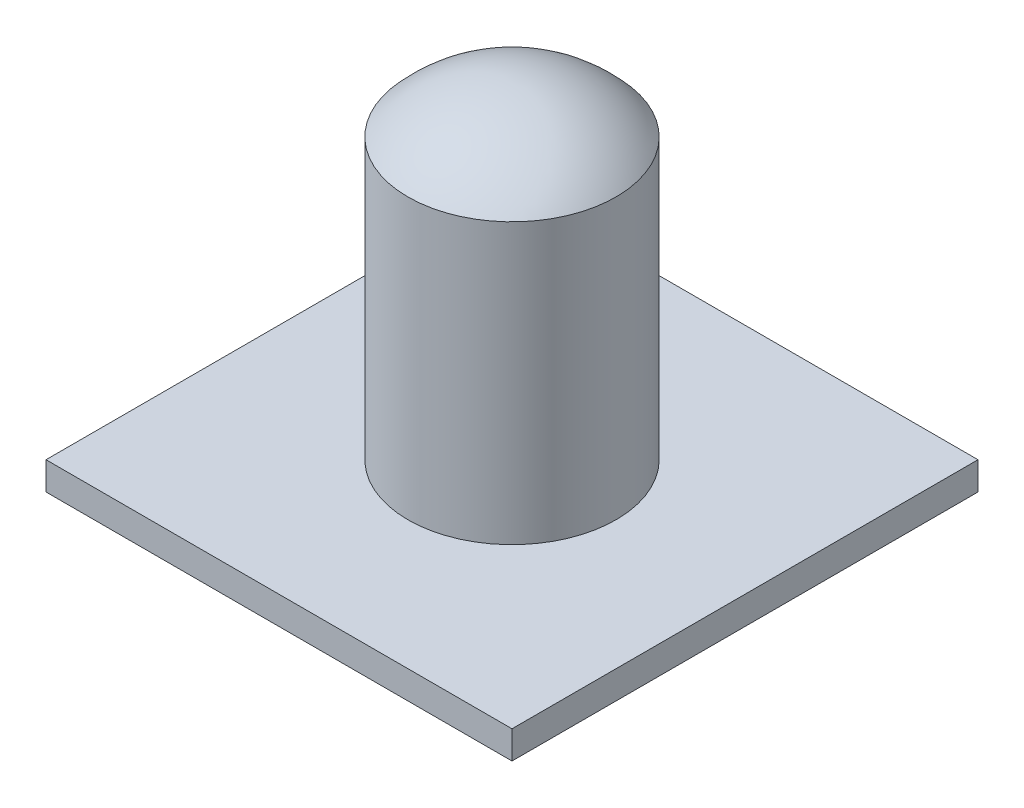
ISO-10303-21;
HEADER;
FILE_DESCRIPTION(('STEP AP214'),'2;1');
FILE_NAME('part.step','',(''),(''),'','','');
FILE_SCHEMA(('AUTOMOTIVE_DESIGN { 1 0 10303 214 1 1 1 1 }'));
ENDSEC;
DATA;
#1=APPLICATION_CONTEXT('core data for automotive mechanical design processes');
#2=APPLICATION_PROTOCOL_DEFINITION('international standard','automotive_design',2000,#1);
#3=PRODUCT_CONTEXT('',#1,'mechanical');
#4=PRODUCT('Part','Part','',(#3));
#5=PRODUCT_RELATED_PRODUCT_CATEGORY('part','',(#4));
#6=PRODUCT_DEFINITION_FORMATION('','',#4);
#7=PRODUCT_DEFINITION_CONTEXT('part definition',#1,'design');
#8=PRODUCT_DEFINITION('design','',#6,#7);
#9=PRODUCT_DEFINITION_SHAPE('','',#8);
#10=(LENGTH_UNIT() NAMED_UNIT(*) SI_UNIT(.MILLI.,.METRE.));
#11=(NAMED_UNIT(*) PLANE_ANGLE_UNIT() SI_UNIT($,.RADIAN.));
#12=(NAMED_UNIT(*) SI_UNIT($,.STERADIAN.) SOLID_ANGLE_UNIT());
#13=UNCERTAINTY_MEASURE_WITH_UNIT(LENGTH_MEASURE(1.E-05),#10,'distance_accuracy_value','');
#14=(GEOMETRIC_REPRESENTATION_CONTEXT(3) GLOBAL_UNCERTAINTY_ASSIGNED_CONTEXT((#13)) GLOBAL_UNIT_ASSIGNED_CONTEXT((#10,
#11,#12)) REPRESENTATION_CONTEXT('',''));
#15=CARTESIAN_POINT('',(0.,0.,0.));
#16=DIRECTION('',(0.,0.,1.));
#17=DIRECTION('',(1.,0.,0.));
#18=AXIS2_PLACEMENT_3D('',#15,#16,#17);
#19=CARTESIAN_POINT('',(-19.05,2.286,-19.05));
#20=DIRECTION('',(1.,0.,0.));
#21=DIRECTION('',(0.,0.,-1.));
#22=AXIS2_PLACEMENT_3D('',#19,#20,#21);
#23=PLANE('',#22);
#24=DIRECTION('',(0.,0.,1.));
#25=VECTOR('',#24,1.);
#26=CARTESIAN_POINT('',(-19.05,0.,-19.05));
#27=LINE('',#26,#25);
#28=CARTESIAN_POINT('',(-19.05,0.,-19.05));
#29=VERTEX_POINT('',#28);
#30=CARTESIAN_POINT('',(-19.05,0.,19.05));
#31=VERTEX_POINT('',#30);
#32=EDGE_CURVE('E115',#29,#31,#27,.T.);
#33=ORIENTED_EDGE('',*,*,#32,.T.);
#34=DIRECTION('',(0.,-1.,0.));
#35=VECTOR('',#34,1.);
#36=CARTESIAN_POINT('',(-19.05,2.286,19.05));
#37=LINE('',#36,#35);
#38=CARTESIAN_POINT('',(-19.05,2.286,19.05));
#39=VERTEX_POINT('',#38);
#40=EDGE_CURVE('E52',#39,#31,#37,.T.);
#41=ORIENTED_EDGE('',*,*,#40,.F.);
#42=DIRECTION('',(0.,0.,1.));
#43=VECTOR('',#42,1.);
#44=CARTESIAN_POINT('',(-19.05,2.286,-19.05));
#45=LINE('',#44,#43);
#46=CARTESIAN_POINT('',(-19.05,2.286,-19.05));
#47=VERTEX_POINT('',#46);
#48=EDGE_CURVE('E97',#47,#39,#45,.T.);
#49=ORIENTED_EDGE('',*,*,#48,.F.);
#50=DIRECTION('',(0.,-1.,0.));
#51=VECTOR('',#50,1.);
#52=CARTESIAN_POINT('',(-19.05,2.286,-19.05));
#53=LINE('',#52,#51);
#54=EDGE_CURVE('E111',#47,#29,#53,.T.);
#55=ORIENTED_EDGE('',*,*,#54,.T.);
#56=EDGE_LOOP('',(#33,#41,#49,#55));
#57=FACE_BOUND('',#56,.T.);
#58=ADVANCED_FACE('F41',(#57),#23,.F.);
#59=CARTESIAN_POINT('',(-19.05,2.286,19.05));
#60=DIRECTION('',(0.,0.,-1.));
#61=DIRECTION('',(-1.,0.,0.));
#62=AXIS2_PLACEMENT_3D('',#59,#60,#61);
#63=PLANE('',#62);
#64=DIRECTION('',(1.,0.,0.));
#65=VECTOR('',#64,1.);
#66=CARTESIAN_POINT('',(-19.05,0.,19.05));
#67=LINE('',#66,#65);
#68=CARTESIAN_POINT('',(19.05,0.,19.05));
#69=VERTEX_POINT('',#68);
#70=EDGE_CURVE('E103',#31,#69,#67,.T.);
#71=ORIENTED_EDGE('',*,*,#70,.T.);
#72=DIRECTION('',(0.,-1.,0.));
#73=VECTOR('',#72,1.);
#74=CARTESIAN_POINT('',(19.05,2.286,19.05));
#75=LINE('',#74,#73);
#76=CARTESIAN_POINT('',(19.05,2.286,19.05));
#77=VERTEX_POINT('',#76);
#78=EDGE_CURVE('E101',#77,#69,#75,.T.);
#79=ORIENTED_EDGE('',*,*,#78,.F.);
#80=DIRECTION('',(1.,0.,0.));
#81=VECTOR('',#80,1.);
#82=CARTESIAN_POINT('',(-19.05,2.286,19.05));
#83=LINE('',#82,#81);
#84=EDGE_CURVE('E92',#39,#77,#83,.T.);
#85=ORIENTED_EDGE('',*,*,#84,.F.);
#86=ORIENTED_EDGE('',*,*,#40,.T.);
#87=EDGE_LOOP('',(#71,#79,#85,#86));
#88=FACE_BOUND('',#87,.T.);
#89=ADVANCED_FACE('F102',(#88),#63,.F.);
#90=CARTESIAN_POINT('',(19.05,2.286,19.05));
#91=DIRECTION('',(-1.,0.,0.));
#92=DIRECTION('',(0.,0.,1.));
#93=AXIS2_PLACEMENT_3D('',#90,#91,#92);
#94=PLANE('',#93);
#95=DIRECTION('',(0.,0.,-1.));
#96=VECTOR('',#95,1.);
#97=CARTESIAN_POINT('',(19.05,0.,19.05));
#98=LINE('',#97,#96);
#99=CARTESIAN_POINT('',(19.05,0.,-19.05));
#100=VERTEX_POINT('',#99);
#101=EDGE_CURVE('E78',#69,#100,#98,.T.);
#102=ORIENTED_EDGE('',*,*,#101,.T.);
#103=DIRECTION('',(0.,-1.,0.));
#104=VECTOR('',#103,1.);
#105=CARTESIAN_POINT('',(19.05,2.286,-19.05));
#106=LINE('',#105,#104);
#107=CARTESIAN_POINT('',(19.05,2.286,-19.05));
#108=VERTEX_POINT('',#107);
#109=EDGE_CURVE('E105',#108,#100,#106,.T.);
#110=ORIENTED_EDGE('',*,*,#109,.F.);
#111=DIRECTION('',(0.,0.,-1.));
#112=VECTOR('',#111,1.);
#113=CARTESIAN_POINT('',(19.05,2.286,19.05));
#114=LINE('',#113,#112);
#115=EDGE_CURVE('E95',#77,#108,#114,.T.);
#116=ORIENTED_EDGE('',*,*,#115,.F.);
#117=ORIENTED_EDGE('',*,*,#78,.T.);
#118=EDGE_LOOP('',(#102,#110,#116,#117));
#119=FACE_BOUND('',#118,.T.);
#120=ADVANCED_FACE('F107',(#119),#94,.F.);
#121=CARTESIAN_POINT('',(19.05,2.286,-19.05));
#122=DIRECTION('',(0.,0.,1.));
#123=DIRECTION('',(1.,0.,0.));
#124=AXIS2_PLACEMENT_3D('',#121,#122,#123);
#125=PLANE('',#124);
#126=DIRECTION('',(-1.,0.,0.));
#127=VECTOR('',#126,1.);
#128=CARTESIAN_POINT('',(19.05,0.,-19.05));
#129=LINE('',#128,#127);
#130=EDGE_CURVE('E84',#100,#29,#129,.T.);
#131=ORIENTED_EDGE('',*,*,#130,.T.);
#132=ORIENTED_EDGE('',*,*,#54,.F.);
#133=DIRECTION('',(-1.,0.,0.));
#134=VECTOR('',#133,1.);
#135=CARTESIAN_POINT('',(19.05,2.286,-19.05));
#136=LINE('',#135,#134);
#137=EDGE_CURVE('E61',#108,#47,#136,.T.);
#138=ORIENTED_EDGE('',*,*,#137,.F.);
#139=ORIENTED_EDGE('',*,*,#109,.T.);
#140=EDGE_LOOP('',(#131,#132,#138,#139));
#141=FACE_BOUND('',#140,.T.);
#142=ADVANCED_FACE('F142',(#141),#125,.F.);
#143=CARTESIAN_POINT('',(0.,2.286,0.));
#144=DIRECTION('',(0.,1.,0.));
#145=DIRECTION('',(0.,0.,1.));
#146=AXIS2_PLACEMENT_3D('',#143,#144,#145);
#147=PLANE('',#146);
#148=CARTESIAN_POINT('',(0.,2.286,0.));
#149=DIRECTION('',(0.,1.,0.));
#150=DIRECTION('',(0.,0.,1.));
#151=AXIS2_PLACEMENT_3D('',#148,#149,#150);
#152=CIRCLE('',#151,8.509);
#153=CARTESIAN_POINT('',(0.,2.286,8.509));
#154=VERTEX_POINT('',#153);
#155=EDGE_CURVE('E11',#154,#154,#152,.T.);
#156=ORIENTED_EDGE('',*,*,#155,.F.);
#157=EDGE_LOOP('',(#156));
#158=FACE_BOUND('',#157,.T.);
#159=ORIENTED_EDGE('',*,*,#48,.T.);
#160=ORIENTED_EDGE('',*,*,#84,.T.);
#161=ORIENTED_EDGE('',*,*,#115,.T.);
#162=ORIENTED_EDGE('',*,*,#137,.T.);
#163=EDGE_LOOP('',(#159,#160,#161,#162));
#164=FACE_BOUND('',#163,.T.);
#165=ADVANCED_FACE('F93',(#158,#164),#147,.T.);
#166=CARTESIAN_POINT('',(0.,0.,0.));
#167=DIRECTION('',(0.,1.,0.));
#168=DIRECTION('',(0.,0.,1.));
#169=AXIS2_PLACEMENT_3D('',#166,#167,#168);
#170=PLANE('',#169);
#171=ORIENTED_EDGE('',*,*,#32,.F.);
#172=ORIENTED_EDGE('',*,*,#130,.F.);
#173=ORIENTED_EDGE('',*,*,#101,.F.);
#174=ORIENTED_EDGE('',*,*,#70,.F.);
#175=EDGE_LOOP('',(#171,#172,#173,#174));
#176=FACE_BOUND('',#175,.T.);
#177=ADVANCED_FACE('F132',(#176),#170,.F.);
#178=CARTESIAN_POINT('',(0.,25.146,0.));
#179=DIRECTION('',(0.,-1.,0.));
#180=DIRECTION('',(0.,0.,-1.));
#181=AXIS2_PLACEMENT_3D('',#178,#179,#180);
#182=CYLINDRICAL_SURFACE('',#181,8.509);
#183=CARTESIAN_POINT('',(0.,25.146,0.));
#184=DIRECTION('',(0.,1.,0.));
#185=DIRECTION('',(0.,0.,1.));
#186=AXIS2_PLACEMENT_3D('',#183,#184,#185);
#187=CIRCLE('',#186,8.509);
#188=CARTESIAN_POINT('',(0.,25.146,8.509));
#189=VERTEX_POINT('',#188);
#190=EDGE_CURVE('E45',#189,#189,#187,.T.);
#191=ORIENTED_EDGE('',*,*,#190,.F.);
#192=EDGE_LOOP('',(#191));
#193=FACE_BOUND('',#192,.T.);
#194=ORIENTED_EDGE('',*,*,#155,.T.);
#195=EDGE_LOOP('',(#194));
#196=FACE_BOUND('',#195,.T.);
#197=ADVANCED_FACE('F134',(#193,#196),#182,.T.);
#198=CARTESIAN_POINT('',(0.,17.5492833333333,0.));
#199=DIRECTION('',(0.,0.,1.));
#200=DIRECTION('',(1.,0.,0.));
#201=AXIS2_PLACEMENT_3D('',#198,#199,#200);
#202=SPHERICAL_SURFACE('',#201,11.4067166666667);
#203=CARTESIAN_POINT('',(0.,17.5492833333333,0.));
#204=DIRECTION('',(0.,1.,0.));
#205=DIRECTION('',(0.,0.,1.));
#206=AXIS2_PLACEMENT_3D('',#203,#204,#205);
#207=SPHERICAL_SURFACE('',#206,11.4067166666667);
#208=ORIENTED_EDGE('',*,*,#190,.T.);
#209=EDGE_LOOP('',(#208));
#210=FACE_BOUND('',#209,.T.);
#211=ADVANCED_FACE('F43',(#210),#207,.T.);
#212=CLOSED_SHELL('',(#58,#89,#120,#142,#165,#177,#197,#211));
#213=MANIFOLD_SOLID_BREP('B2',#212);
#214=ADVANCED_BREP_SHAPE_REPRESENTATION('',(#18,#213),#14);
#215=SHAPE_DEFINITION_REPRESENTATION(#9,#214);
ENDSEC;
END-ISO-10303-21;
